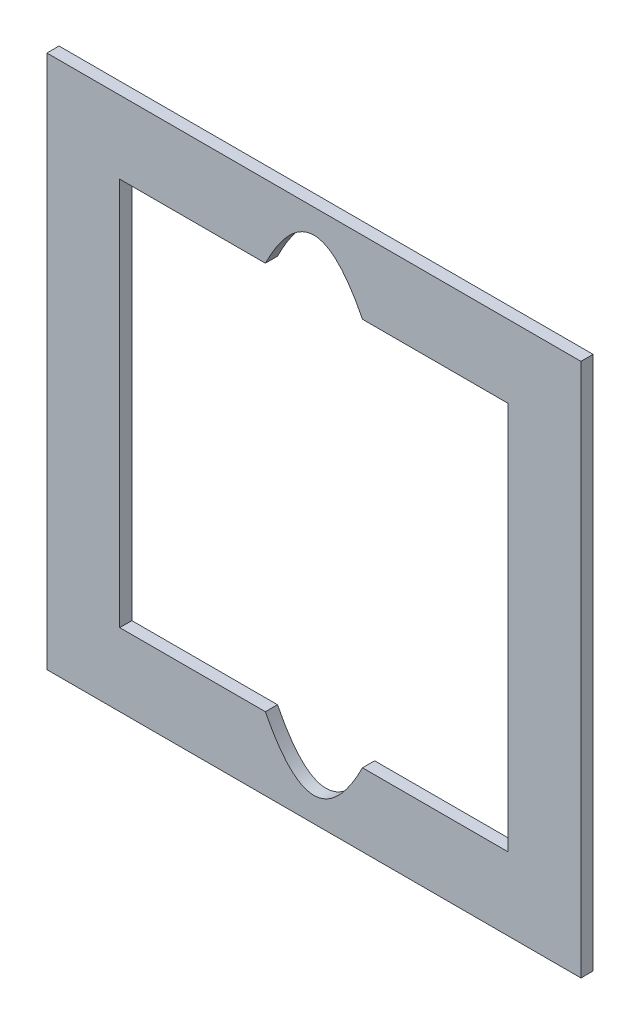
ISO-10303-21;
HEADER;
FILE_DESCRIPTION(('STEP AP214'),'2;1');
FILE_NAME('part.step','',(''),(''),'','','');
FILE_SCHEMA(('AUTOMOTIVE_DESIGN { 1 0 10303 214 1 1 1 1 }'));
ENDSEC;
DATA;
#1=APPLICATION_CONTEXT('core data for automotive mechanical design processes');
#2=APPLICATION_PROTOCOL_DEFINITION('international standard','automotive_design',2000,#1);
#3=PRODUCT_CONTEXT('',#1,'mechanical');
#4=PRODUCT('Part','Part','',(#3));
#5=PRODUCT_RELATED_PRODUCT_CATEGORY('part','',(#4));
#6=PRODUCT_DEFINITION_FORMATION('','',#4);
#7=PRODUCT_DEFINITION_CONTEXT('part definition',#1,'design');
#8=PRODUCT_DEFINITION('design','',#6,#7);
#9=PRODUCT_DEFINITION_SHAPE('','',#8);
#10=(LENGTH_UNIT() NAMED_UNIT(*) SI_UNIT(.MILLI.,.METRE.));
#11=(NAMED_UNIT(*) PLANE_ANGLE_UNIT() SI_UNIT($,.RADIAN.));
#12=(NAMED_UNIT(*) SI_UNIT($,.STERADIAN.) SOLID_ANGLE_UNIT());
#13=UNCERTAINTY_MEASURE_WITH_UNIT(LENGTH_MEASURE(1.E-05),#10,'distance_accuracy_value','');
#14=(GEOMETRIC_REPRESENTATION_CONTEXT(3) GLOBAL_UNCERTAINTY_ASSIGNED_CONTEXT((#13)) GLOBAL_UNIT_ASSIGNED_CONTEXT((#10,
#11,#12)) REPRESENTATION_CONTEXT('',''));
#15=CARTESIAN_POINT('',(0.,0.,0.));
#16=DIRECTION('',(0.,0.,1.));
#17=DIRECTION('',(1.,0.,0.));
#18=AXIS2_PLACEMENT_3D('',#15,#16,#17);
#19=CARTESIAN_POINT('',(0.,0.,3.175));
#20=DIRECTION('',(0.,0.,-1.));
#21=DIRECTION('',(-1.,0.,0.));
#22=AXIS2_PLACEMENT_3D('',#19,#20,#21);
#23=PLANE('',#22);
#24=DIRECTION('',(0.,-1.,0.));
#25=VECTOR('',#24,1.);
#26=CARTESIAN_POINT('',(0.,0.,3.175));
#27=LINE('',#26,#25);
#28=CARTESIAN_POINT('',(0.,139.7,3.175));
#29=VERTEX_POINT('',#28);
#30=CARTESIAN_POINT('',(0.,0.,3.175));
#31=VERTEX_POINT('',#30);
#32=EDGE_CURVE('E206',#29,#31,#27,.T.);
#33=ORIENTED_EDGE('',*,*,#32,.T.);
#34=DIRECTION('',(1.,0.,0.));
#35=VECTOR('',#34,1.);
#36=CARTESIAN_POINT('',(0.,0.,3.175));
#37=LINE('',#36,#35);
#38=CARTESIAN_POINT('',(139.7,0.,3.175));
#39=VERTEX_POINT('',#38);
#40=EDGE_CURVE('E219',#31,#39,#37,.T.);
#41=ORIENTED_EDGE('',*,*,#40,.T.);
#42=DIRECTION('',(0.,1.,0.));
#43=VECTOR('',#42,1.);
#44=CARTESIAN_POINT('',(139.7,0.,3.175));
#45=LINE('',#44,#43);
#46=CARTESIAN_POINT('',(139.7,139.7,3.175));
#47=VERTEX_POINT('',#46);
#48=EDGE_CURVE('E200',#39,#47,#45,.T.);
#49=ORIENTED_EDGE('',*,*,#48,.T.);
#50=DIRECTION('',(-1.,0.,0.));
#51=VECTOR('',#50,1.);
#52=CARTESIAN_POINT('',(0.,139.7,3.175));
#53=LINE('',#52,#51);
#54=EDGE_CURVE('E213',#47,#29,#53,.T.);
#55=ORIENTED_EDGE('',*,*,#54,.T.);
#56=EDGE_LOOP('',(#33,#41,#49,#55));
#57=FACE_BOUND('',#56,.T.);
#58=DIRECTION('',(0.,-1.,0.));
#59=VECTOR('',#58,1.);
#60=CARTESIAN_POINT('',(19.05,120.65,3.175));
#61=LINE('',#60,#59);
#62=CARTESIAN_POINT('',(19.05,120.65,3.175));
#63=VERTEX_POINT('',#62);
#64=CARTESIAN_POINT('',(19.05,19.05,3.175));
#65=VERTEX_POINT('',#64);
#66=EDGE_CURVE('E122',#63,#65,#61,.T.);
#67=ORIENTED_EDGE('',*,*,#66,.F.);
#68=DIRECTION('',(-1.,0.,0.));
#69=VECTOR('',#68,1.);
#70=CARTESIAN_POINT('',(19.05,120.65,3.175));
#71=LINE('',#70,#69);
#72=CARTESIAN_POINT('',(57.15,120.65,3.175));
#73=VERTEX_POINT('',#72);
#74=EDGE_CURVE('E235',#73,#63,#71,.T.);
#75=ORIENTED_EDGE('',*,*,#74,.F.);
#76=CARTESIAN_POINT('',(82.55,120.65,3.175));
#77=CARTESIAN_POINT('',(69.85,146.05,3.175));
#78=CARTESIAN_POINT('',(57.15,120.65,3.175));
#79=B_SPLINE_CURVE_WITH_KNOTS('',2,(#76,#77,#78),.UNSPECIFIED.,.F.,.F.,(3,3),(0.,1.),.UNSPECIFIED.);
#80=CARTESIAN_POINT('',(82.55,120.65,3.175));
#81=VERTEX_POINT('',#80);
#82=EDGE_CURVE('E266',#81,#73,#79,.T.);
#83=ORIENTED_EDGE('',*,*,#82,.F.);
#84=DIRECTION('',(-1.,0.,0.));
#85=VECTOR('',#84,1.);
#86=CARTESIAN_POINT('',(82.55,120.65,3.175));
#87=LINE('',#86,#85);
#88=CARTESIAN_POINT('',(120.65,120.65,3.175));
#89=VERTEX_POINT('',#88);
#90=EDGE_CURVE('E271',#89,#81,#87,.T.);
#91=ORIENTED_EDGE('',*,*,#90,.F.);
#92=DIRECTION('',(0.,1.,0.));
#93=VECTOR('',#92,1.);
#94=CARTESIAN_POINT('',(120.65,120.65,3.175));
#95=LINE('',#94,#93);
#96=CARTESIAN_POINT('',(120.65,19.05,3.175));
#97=VERTEX_POINT('',#96);
#98=EDGE_CURVE('E300',#97,#89,#95,.T.);
#99=ORIENTED_EDGE('',*,*,#98,.F.);
#100=DIRECTION('',(1.,0.,0.));
#101=VECTOR('',#100,1.);
#102=CARTESIAN_POINT('',(82.55,19.05,3.175));
#103=LINE('',#102,#101);
#104=CARTESIAN_POINT('',(82.55,19.05,3.175));
#105=VERTEX_POINT('',#104);
#106=EDGE_CURVE('E145',#105,#97,#103,.T.);
#107=ORIENTED_EDGE('',*,*,#106,.F.);
#108=CARTESIAN_POINT('',(57.15,19.05,3.175));
#109=CARTESIAN_POINT('',(69.85,-6.15535071933514,3.175));
#110=CARTESIAN_POINT('',(82.55,19.05,3.175));
#111=B_SPLINE_CURVE_WITH_KNOTS('',2,(#108,#109,#110),.UNSPECIFIED.,.F.,.F.,(3,3),(0.,1.),.UNSPECIFIED.);
#112=CARTESIAN_POINT('',(57.15,19.05,3.175));
#113=VERTEX_POINT('',#112);
#114=EDGE_CURVE('E143',#113,#105,#111,.T.);
#115=ORIENTED_EDGE('',*,*,#114,.F.);
#116=DIRECTION('',(1.,0.,0.));
#117=VECTOR('',#116,1.);
#118=CARTESIAN_POINT('',(19.05,19.05,3.175));
#119=LINE('',#118,#117);
#120=EDGE_CURVE('E130',#65,#113,#119,.T.);
#121=ORIENTED_EDGE('',*,*,#120,.F.);
#122=EDGE_LOOP('',(#67,#75,#83,#91,#99,#107,#115,#121));
#123=FACE_BOUND('',#122,.T.);
#124=ADVANCED_FACE('F33',(#57,#123),#23,.F.);
#125=CARTESIAN_POINT('',(0.,0.,0.));
#126=DIRECTION('',(0.,0.,-1.));
#127=DIRECTION('',(-1.,0.,0.));
#128=AXIS2_PLACEMENT_3D('',#125,#126,#127);
#129=PLANE('',#128);
#130=DIRECTION('',(0.,-1.,0.));
#131=VECTOR('',#130,1.);
#132=CARTESIAN_POINT('',(0.,0.,0.));
#133=LINE('',#132,#131);
#134=CARTESIAN_POINT('',(0.,139.7,0.));
#135=VERTEX_POINT('',#134);
#136=CARTESIAN_POINT('',(0.,0.,0.));
#137=VERTEX_POINT('',#136);
#138=EDGE_CURVE('E138',#135,#137,#133,.T.);
#139=ORIENTED_EDGE('',*,*,#138,.F.);
#140=DIRECTION('',(-1.,0.,0.));
#141=VECTOR('',#140,1.);
#142=CARTESIAN_POINT('',(0.,139.7,0.));
#143=LINE('',#142,#141);
#144=CARTESIAN_POINT('',(139.7,139.7,0.));
#145=VERTEX_POINT('',#144);
#146=EDGE_CURVE('E204',#145,#135,#143,.T.);
#147=ORIENTED_EDGE('',*,*,#146,.F.);
#148=DIRECTION('',(0.,1.,0.));
#149=VECTOR('',#148,1.);
#150=CARTESIAN_POINT('',(139.7,0.,0.));
#151=LINE('',#150,#149);
#152=CARTESIAN_POINT('',(139.7,0.,0.));
#153=VERTEX_POINT('',#152);
#154=EDGE_CURVE('E196',#153,#145,#151,.T.);
#155=ORIENTED_EDGE('',*,*,#154,.F.);
#156=DIRECTION('',(1.,0.,0.));
#157=VECTOR('',#156,1.);
#158=CARTESIAN_POINT('',(0.,0.,0.));
#159=LINE('',#158,#157);
#160=EDGE_CURVE('E189',#137,#153,#159,.T.);
#161=ORIENTED_EDGE('',*,*,#160,.F.);
#162=EDGE_LOOP('',(#139,#147,#155,#161));
#163=FACE_BOUND('',#162,.T.);
#164=DIRECTION('',(-1.,0.,0.));
#165=VECTOR('',#164,1.);
#166=CARTESIAN_POINT('',(19.05,120.65,0.));
#167=LINE('',#166,#165);
#168=CARTESIAN_POINT('',(57.15,120.65,0.));
#169=VERTEX_POINT('',#168);
#170=CARTESIAN_POINT('',(19.05,120.65,0.));
#171=VERTEX_POINT('',#170);
#172=EDGE_CURVE('E131',#169,#171,#167,.T.);
#173=ORIENTED_EDGE('',*,*,#172,.T.);
#174=DIRECTION('',(0.,-1.,0.));
#175=VECTOR('',#174,1.);
#176=CARTESIAN_POINT('',(19.05,120.65,0.));
#177=LINE('',#176,#175);
#178=CARTESIAN_POINT('',(19.05,19.05,0.));
#179=VERTEX_POINT('',#178);
#180=EDGE_CURVE('E56',#171,#179,#177,.T.);
#181=ORIENTED_EDGE('',*,*,#180,.T.);
#182=DIRECTION('',(1.,0.,0.));
#183=VECTOR('',#182,1.);
#184=CARTESIAN_POINT('',(19.05,19.05,0.));
#185=LINE('',#184,#183);
#186=CARTESIAN_POINT('',(57.15,19.05,0.));
#187=VERTEX_POINT('',#186);
#188=EDGE_CURVE('E137',#179,#187,#185,.T.);
#189=ORIENTED_EDGE('',*,*,#188,.T.);
#190=CARTESIAN_POINT('',(57.15,19.05,0.));
#191=CARTESIAN_POINT('',(69.85,-6.15535071933514,0.));
#192=CARTESIAN_POINT('',(82.55,19.05,0.));
#193=B_SPLINE_CURVE_WITH_KNOTS('',2,(#190,#191,#192),.UNSPECIFIED.,.F.,.F.,(3,3),(0.,1.),.UNSPECIFIED.);
#194=CARTESIAN_POINT('',(82.55,19.05,0.));
#195=VERTEX_POINT('',#194);
#196=EDGE_CURVE('E255',#187,#195,#193,.T.);
#197=ORIENTED_EDGE('',*,*,#196,.T.);
#198=DIRECTION('',(1.,0.,0.));
#199=VECTOR('',#198,1.);
#200=CARTESIAN_POINT('',(82.55,19.05,0.));
#201=LINE('',#200,#199);
#202=CARTESIAN_POINT('',(120.65,19.05,0.));
#203=VERTEX_POINT('',#202);
#204=EDGE_CURVE('E252',#195,#203,#201,.T.);
#205=ORIENTED_EDGE('',*,*,#204,.T.);
#206=DIRECTION('',(0.,1.,0.));
#207=VECTOR('',#206,1.);
#208=CARTESIAN_POINT('',(120.65,120.65,0.));
#209=LINE('',#208,#207);
#210=CARTESIAN_POINT('',(120.65,120.65,0.));
#211=VERTEX_POINT('',#210);
#212=EDGE_CURVE('E249',#203,#211,#209,.T.);
#213=ORIENTED_EDGE('',*,*,#212,.T.);
#214=DIRECTION('',(-1.,0.,0.));
#215=VECTOR('',#214,1.);
#216=CARTESIAN_POINT('',(82.55,120.65,0.));
#217=LINE('',#216,#215);
#218=CARTESIAN_POINT('',(82.55,120.65,0.));
#219=VERTEX_POINT('',#218);
#220=EDGE_CURVE('E243',#211,#219,#217,.T.);
#221=ORIENTED_EDGE('',*,*,#220,.T.);
#222=CARTESIAN_POINT('',(82.55,120.65,0.));
#223=CARTESIAN_POINT('',(69.85,146.05,0.));
#224=CARTESIAN_POINT('',(57.15,120.65,0.));
#225=B_SPLINE_CURVE_WITH_KNOTS('',2,(#222,#223,#224),.UNSPECIFIED.,.F.,.F.,(3,3),(0.,1.),.UNSPECIFIED.);
#226=EDGE_CURVE('E238',#219,#169,#225,.T.);
#227=ORIENTED_EDGE('',*,*,#226,.T.);
#228=EDGE_LOOP('',(#173,#181,#189,#197,#205,#213,#221,#227));
#229=FACE_BOUND('',#228,.T.);
#230=ADVANCED_FACE('F170',(#163,#229),#129,.T.);
#231=CARTESIAN_POINT('',(0.,0.,3.175));
#232=DIRECTION('',(1.,0.,0.));
#233=DIRECTION('',(0.,0.,-1.));
#234=AXIS2_PLACEMENT_3D('',#231,#232,#233);
#235=PLANE('',#234);
#236=ORIENTED_EDGE('',*,*,#138,.T.);
#237=DIRECTION('',(0.,0.,-1.));
#238=VECTOR('',#237,1.);
#239=CARTESIAN_POINT('',(0.,0.,3.175));
#240=LINE('',#239,#238);
#241=EDGE_CURVE('E11',#31,#137,#240,.T.);
#242=ORIENTED_EDGE('',*,*,#241,.F.);
#243=ORIENTED_EDGE('',*,*,#32,.F.);
#244=DIRECTION('',(0.,0.,-1.));
#245=VECTOR('',#244,1.);
#246=CARTESIAN_POINT('',(0.,139.7,3.175));
#247=LINE('',#246,#245);
#248=EDGE_CURVE('E210',#29,#135,#247,.T.);
#249=ORIENTED_EDGE('',*,*,#248,.T.);
#250=EDGE_LOOP('',(#236,#242,#243,#249));
#251=FACE_BOUND('',#250,.T.);
#252=ADVANCED_FACE('F35',(#251),#235,.F.);
#253=CARTESIAN_POINT('',(0.,0.,3.175));
#254=DIRECTION('',(0.,1.,0.));
#255=DIRECTION('',(0.,0.,1.));
#256=AXIS2_PLACEMENT_3D('',#253,#254,#255);
#257=PLANE('',#256);
#258=ORIENTED_EDGE('',*,*,#160,.T.);
#259=DIRECTION('',(0.,0.,-1.));
#260=VECTOR('',#259,1.);
#261=CARTESIAN_POINT('',(139.7,0.,3.175));
#262=LINE('',#261,#260);
#263=EDGE_CURVE('E41',#39,#153,#262,.T.);
#264=ORIENTED_EDGE('',*,*,#263,.F.);
#265=ORIENTED_EDGE('',*,*,#40,.F.);
#266=ORIENTED_EDGE('',*,*,#241,.T.);
#267=EDGE_LOOP('',(#258,#264,#265,#266));
#268=FACE_BOUND('',#267,.T.);
#269=ADVANCED_FACE('F180',(#268),#257,.F.);
#270=CARTESIAN_POINT('',(139.7,0.,3.175));
#271=DIRECTION('',(-1.,0.,0.));
#272=DIRECTION('',(0.,0.,1.));
#273=AXIS2_PLACEMENT_3D('',#270,#271,#272);
#274=PLANE('',#273);
#275=ORIENTED_EDGE('',*,*,#154,.T.);
#276=DIRECTION('',(0.,0.,-1.));
#277=VECTOR('',#276,1.);
#278=CARTESIAN_POINT('',(139.7,139.7,3.175));
#279=LINE('',#278,#277);
#280=EDGE_CURVE('E201',#47,#145,#279,.T.);
#281=ORIENTED_EDGE('',*,*,#280,.F.);
#282=ORIENTED_EDGE('',*,*,#48,.F.);
#283=ORIENTED_EDGE('',*,*,#263,.T.);
#284=EDGE_LOOP('',(#275,#281,#282,#283));
#285=FACE_BOUND('',#284,.T.);
#286=ADVANCED_FACE('F177',(#285),#274,.F.);
#287=CARTESIAN_POINT('',(0.,139.7,3.175));
#288=DIRECTION('',(0.,-1.,0.));
#289=DIRECTION('',(0.,0.,-1.));
#290=AXIS2_PLACEMENT_3D('',#287,#288,#289);
#291=PLANE('',#290);
#292=ORIENTED_EDGE('',*,*,#146,.T.);
#293=ORIENTED_EDGE('',*,*,#248,.F.);
#294=ORIENTED_EDGE('',*,*,#54,.F.);
#295=ORIENTED_EDGE('',*,*,#280,.T.);
#296=EDGE_LOOP('',(#292,#293,#294,#295));
#297=FACE_BOUND('',#296,.T.);
#298=ADVANCED_FACE('F167',(#297),#291,.F.);
#299=CARTESIAN_POINT('',(19.05,120.65,3.175));
#300=DIRECTION('',(1.,0.,0.));
#301=DIRECTION('',(0.,0.,-1.));
#302=AXIS2_PLACEMENT_3D('',#299,#300,#301);
#303=PLANE('',#302);
#304=ORIENTED_EDGE('',*,*,#180,.F.);
#305=DIRECTION('',(0.,0.,-1.));
#306=VECTOR('',#305,1.);
#307=CARTESIAN_POINT('',(19.05,120.65,3.175));
#308=LINE('',#307,#306);
#309=EDGE_CURVE('E126',#63,#171,#308,.T.);
#310=ORIENTED_EDGE('',*,*,#309,.F.);
#311=ORIENTED_EDGE('',*,*,#66,.T.);
#312=DIRECTION('',(0.,0.,-1.));
#313=VECTOR('',#312,1.);
#314=CARTESIAN_POINT('',(19.05,19.05,3.175));
#315=LINE('',#314,#313);
#316=EDGE_CURVE('E125',#65,#179,#315,.T.);
#317=ORIENTED_EDGE('',*,*,#316,.T.);
#318=EDGE_LOOP('',(#304,#310,#311,#317));
#319=FACE_BOUND('',#318,.T.);
#320=ADVANCED_FACE('F124',(#319),#303,.T.);
#321=CARTESIAN_POINT('',(19.05,19.05,3.175));
#322=DIRECTION('',(0.,1.,0.));
#323=DIRECTION('',(0.,0.,1.));
#324=AXIS2_PLACEMENT_3D('',#321,#322,#323);
#325=PLANE('',#324);
#326=ORIENTED_EDGE('',*,*,#188,.F.);
#327=ORIENTED_EDGE('',*,*,#316,.F.);
#328=ORIENTED_EDGE('',*,*,#120,.T.);
#329=DIRECTION('',(0.,0.,-1.));
#330=VECTOR('',#329,1.);
#331=CARTESIAN_POINT('',(57.15,19.05,3.175));
#332=LINE('',#331,#330);
#333=EDGE_CURVE('E139',#113,#187,#332,.T.);
#334=ORIENTED_EDGE('',*,*,#333,.T.);
#335=EDGE_LOOP('',(#326,#327,#328,#334));
#336=FACE_BOUND('',#335,.T.);
#337=ADVANCED_FACE('F134',(#336),#325,.T.);
#338=DIRECTION('',(0.,0.,-1.));
#339=VECTOR('',#338,1.);
#340=SURFACE_OF_LINEAR_EXTRUSION('',#111,#339);
#341=ORIENTED_EDGE('',*,*,#196,.F.);
#342=ORIENTED_EDGE('',*,*,#333,.F.);
#343=ORIENTED_EDGE('',*,*,#114,.T.);
#344=DIRECTION('',(0.,0.,-1.));
#345=VECTOR('',#344,1.);
#346=CARTESIAN_POINT('',(82.55,19.05,3.175));
#347=LINE('',#346,#345);
#348=EDGE_CURVE('E225',#105,#195,#347,.T.);
#349=ORIENTED_EDGE('',*,*,#348,.T.);
#350=EDGE_LOOP('',(#341,#342,#343,#349));
#351=FACE_BOUND('',#350,.T.);
#352=ADVANCED_FACE('F156',(#351),#340,.T.);
#353=CARTESIAN_POINT('',(82.55,19.05,3.175));
#354=DIRECTION('',(0.,1.,0.));
#355=DIRECTION('',(0.,0.,1.));
#356=AXIS2_PLACEMENT_3D('',#353,#354,#355);
#357=PLANE('',#356);
#358=ORIENTED_EDGE('',*,*,#204,.F.);
#359=ORIENTED_EDGE('',*,*,#348,.F.);
#360=ORIENTED_EDGE('',*,*,#106,.T.);
#361=DIRECTION('',(0.,0.,-1.));
#362=VECTOR('',#361,1.);
#363=CARTESIAN_POINT('',(120.65,19.05,3.175));
#364=LINE('',#363,#362);
#365=EDGE_CURVE('E227',#97,#203,#364,.T.);
#366=ORIENTED_EDGE('',*,*,#365,.T.);
#367=EDGE_LOOP('',(#358,#359,#360,#366));
#368=FACE_BOUND('',#367,.T.);
#369=ADVANCED_FACE('F160',(#368),#357,.T.);
#370=CARTESIAN_POINT('',(120.65,120.65,3.175));
#371=DIRECTION('',(-1.,0.,0.));
#372=DIRECTION('',(0.,0.,1.));
#373=AXIS2_PLACEMENT_3D('',#370,#371,#372);
#374=PLANE('',#373);
#375=ORIENTED_EDGE('',*,*,#212,.F.);
#376=ORIENTED_EDGE('',*,*,#365,.F.);
#377=ORIENTED_EDGE('',*,*,#98,.T.);
#378=DIRECTION('',(0.,0.,-1.));
#379=VECTOR('',#378,1.);
#380=CARTESIAN_POINT('',(120.65,120.65,3.175));
#381=LINE('',#380,#379);
#382=EDGE_CURVE('E229',#89,#211,#381,.T.);
#383=ORIENTED_EDGE('',*,*,#382,.T.);
#384=EDGE_LOOP('',(#375,#376,#377,#383));
#385=FACE_BOUND('',#384,.T.);
#386=ADVANCED_FACE('F284',(#385),#374,.T.);
#387=CARTESIAN_POINT('',(82.55,120.65,3.175));
#388=DIRECTION('',(0.,-1.,0.));
#389=DIRECTION('',(0.,0.,-1.));
#390=AXIS2_PLACEMENT_3D('',#387,#388,#389);
#391=PLANE('',#390);
#392=ORIENTED_EDGE('',*,*,#220,.F.);
#393=ORIENTED_EDGE('',*,*,#382,.F.);
#394=ORIENTED_EDGE('',*,*,#90,.T.);
#395=DIRECTION('',(0.,0.,-1.));
#396=VECTOR('',#395,1.);
#397=CARTESIAN_POINT('',(82.55,120.65,3.175));
#398=LINE('',#397,#396);
#399=EDGE_CURVE('E231',#81,#219,#398,.T.);
#400=ORIENTED_EDGE('',*,*,#399,.T.);
#401=EDGE_LOOP('',(#392,#393,#394,#400));
#402=FACE_BOUND('',#401,.T.);
#403=ADVANCED_FACE('F281',(#402),#391,.T.);
#404=DIRECTION('',(0.,0.,-1.));
#405=VECTOR('',#404,1.);
#406=SURFACE_OF_LINEAR_EXTRUSION('',#79,#405);
#407=ORIENTED_EDGE('',*,*,#226,.F.);
#408=ORIENTED_EDGE('',*,*,#399,.F.);
#409=ORIENTED_EDGE('',*,*,#82,.T.);
#410=DIRECTION('',(0.,0.,-1.));
#411=VECTOR('',#410,1.);
#412=CARTESIAN_POINT('',(57.15,120.65,3.175));
#413=LINE('',#412,#411);
#414=EDGE_CURVE('E48',#73,#169,#413,.T.);
#415=ORIENTED_EDGE('',*,*,#414,.T.);
#416=EDGE_LOOP('',(#407,#408,#409,#415));
#417=FACE_BOUND('',#416,.T.);
#418=ADVANCED_FACE('F276',(#417),#406,.T.);
#419=CARTESIAN_POINT('',(19.05,120.65,3.175));
#420=DIRECTION('',(0.,-1.,0.));
#421=DIRECTION('',(0.,0.,-1.));
#422=AXIS2_PLACEMENT_3D('',#419,#420,#421);
#423=PLANE('',#422);
#424=ORIENTED_EDGE('',*,*,#172,.F.);
#425=ORIENTED_EDGE('',*,*,#414,.F.);
#426=ORIENTED_EDGE('',*,*,#74,.T.);
#427=ORIENTED_EDGE('',*,*,#309,.T.);
#428=EDGE_LOOP('',(#424,#425,#426,#427));
#429=FACE_BOUND('',#428,.T.);
#430=ADVANCED_FACE('F280',(#429),#423,.T.);
#431=CLOSED_SHELL('',(#124,#230,#252,#269,#286,#298,#320,#337,#352,#369,#386,#403,#418,#430));
#432=MANIFOLD_SOLID_BREP('B2',#431);
#433=ADVANCED_BREP_SHAPE_REPRESENTATION('',(#18,#432),#14);
#434=SHAPE_DEFINITION_REPRESENTATION(#9,#433);
ENDSEC;
END-ISO-10303-21;
